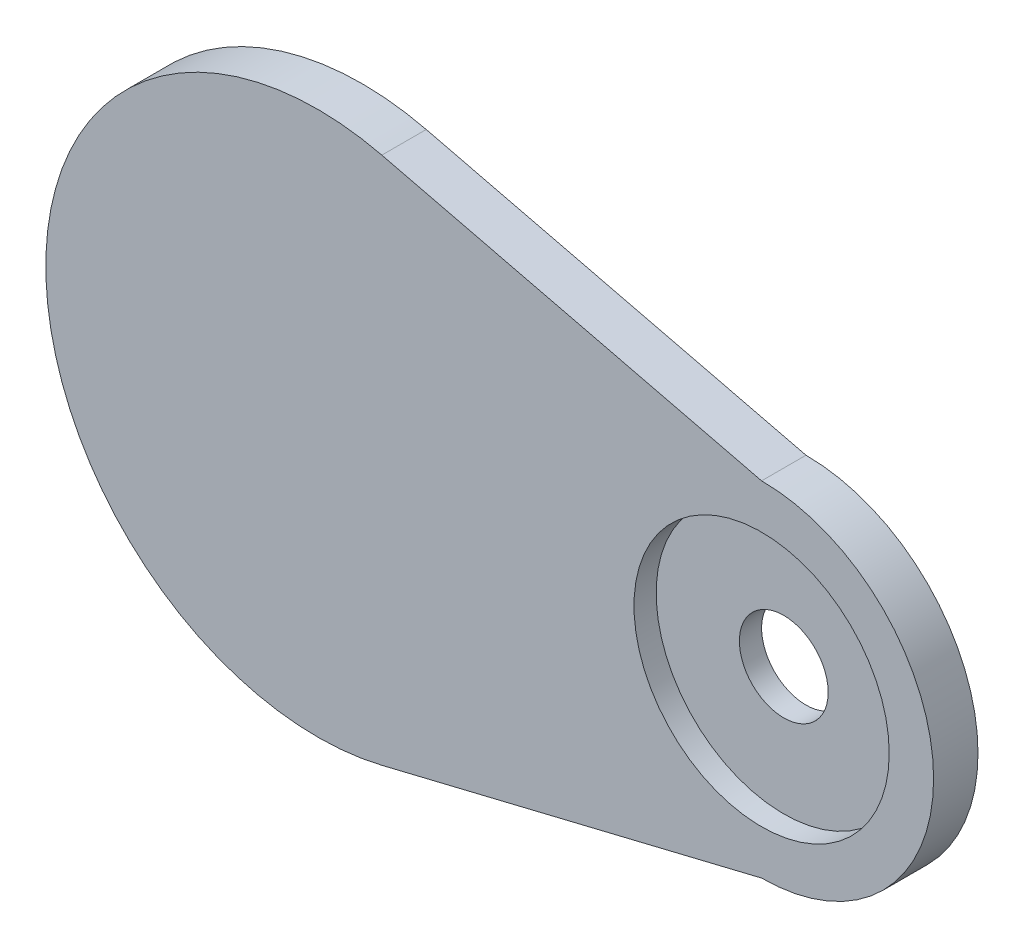
ISO-10303-21;
HEADER;
FILE_DESCRIPTION(('STEP AP214'),'2;1');
FILE_NAME('part.step','',(''),(''),'','','');
FILE_SCHEMA(('AUTOMOTIVE_DESIGN { 1 0 10303 214 1 1 1 1 }'));
ENDSEC;
DATA;
#1=APPLICATION_CONTEXT('core data for automotive mechanical design processes');
#2=APPLICATION_PROTOCOL_DEFINITION('international standard','automotive_design',2000,#1);
#3=PRODUCT_CONTEXT('',#1,'mechanical');
#4=PRODUCT('Part','Part','',(#3));
#5=PRODUCT_RELATED_PRODUCT_CATEGORY('part','',(#4));
#6=PRODUCT_DEFINITION_FORMATION('','',#4);
#7=PRODUCT_DEFINITION_CONTEXT('part definition',#1,'design');
#8=PRODUCT_DEFINITION('design','',#6,#7);
#9=PRODUCT_DEFINITION_SHAPE('','',#8);
#10=(LENGTH_UNIT() NAMED_UNIT(*) SI_UNIT(.MILLI.,.METRE.));
#11=(NAMED_UNIT(*) PLANE_ANGLE_UNIT() SI_UNIT($,.RADIAN.));
#12=(NAMED_UNIT(*) SI_UNIT($,.STERADIAN.) SOLID_ANGLE_UNIT());
#13=UNCERTAINTY_MEASURE_WITH_UNIT(LENGTH_MEASURE(1.E-05),#10,'distance_accuracy_value','');
#14=(GEOMETRIC_REPRESENTATION_CONTEXT(3) GLOBAL_UNCERTAINTY_ASSIGNED_CONTEXT((#13)) GLOBAL_UNIT_ASSIGNED_CONTEXT((#10,
#11,#12)) REPRESENTATION_CONTEXT('',''));
#15=CARTESIAN_POINT('',(0.,0.,0.));
#16=DIRECTION('',(0.,0.,1.));
#17=DIRECTION('',(1.,0.,0.));
#18=AXIS2_PLACEMENT_3D('',#15,#16,#17);
#19=CARTESIAN_POINT('',(4.50352233774654,18.5486828000679,4.));
#20=DIRECTION('',(-0.235940050150018,-0.971767612516082,0.));
#21=DIRECTION('',(0.971767612516082,-0.235940050150018,0.));
#22=AXIS2_PLACEMENT_3D('',#19,#20,#21);
#23=PLANE('',#22);
#24=DIRECTION('',(-0.971767612516082,0.235940050150018,0.));
#25=VECTOR('',#24,1.);
#26=CARTESIAN_POINT('',(4.50352233774654,18.5486828000679,0.));
#27=LINE('',#26,#25);
#28=CARTESIAN_POINT('',(13.4906393989021,16.3666581855379,0.));
#29=VERTEX_POINT('',#28);
#30=CARTESIAN_POINT('',(-20.7288293724225,24.674964692182,0.));
#31=VERTEX_POINT('',#30);
#32=EDGE_CURVE('E114',#29,#31,#27,.T.);
#33=ORIENTED_EDGE('',*,*,#32,.T.);
#34=DIRECTION('',(0.,0.,-1.));
#35=VECTOR('',#34,1.);
#36=CARTESIAN_POINT('',(-20.7288293724225,24.674964692182,4.));
#37=LINE('',#36,#35);
#38=CARTESIAN_POINT('',(-20.7288293724225,24.674964692182,4.));
#39=VERTEX_POINT('',#38);
#40=EDGE_CURVE('E11',#39,#31,#37,.T.);
#41=ORIENTED_EDGE('',*,*,#40,.F.);
#42=DIRECTION('',(-0.971767612516082,0.235940050150018,0.));
#43=VECTOR('',#42,1.);
#44=CARTESIAN_POINT('',(4.50352233774654,18.5486828000679,4.));
#45=LINE('',#44,#43);
#46=CARTESIAN_POINT('',(13.4906393989021,16.3666581855379,4.));
#47=VERTEX_POINT('',#46);
#48=EDGE_CURVE('E95',#47,#39,#45,.T.);
#49=ORIENTED_EDGE('',*,*,#48,.F.);
#50=DIRECTION('',(0.,0.,-1.));
#51=VECTOR('',#50,1.);
#52=CARTESIAN_POINT('',(13.4906393989021,16.3666581855379,4.));
#53=LINE('',#52,#51);
#54=EDGE_CURVE('E110',#47,#29,#53,.T.);
#55=ORIENTED_EDGE('',*,*,#54,.T.);
#56=EDGE_LOOP('',(#33,#41,#49,#55));
#57=FACE_BOUND('',#56,.T.);
#58=ADVANCED_FACE('F47',(#57),#23,.F.);
#59=CARTESIAN_POINT('',(-26.5093606010979,0.866658185537944,4.));
#60=DIRECTION('',(0.,0.,-1.));
#61=DIRECTION('',(-1.,0.,0.));
#62=AXIS2_PLACEMENT_3D('',#59,#60,#61);
#63=CYLINDRICAL_SURFACE('',#62,24.5);
#64=CARTESIAN_POINT('',(-26.5093606010979,0.866658185537944,0.));
#65=DIRECTION('',(0.,0.,1.));
#66=DIRECTION('',(1.,0.,0.));
#67=AXIS2_PLACEMENT_3D('',#64,#65,#66);
#68=CIRCLE('',#67,24.5);
#69=CARTESIAN_POINT('',(-20.7288293724225,-22.9416483211061,0.));
#70=VERTEX_POINT('',#69);
#71=EDGE_CURVE('E101',#31,#70,#68,.T.);
#72=ORIENTED_EDGE('',*,*,#71,.T.);
#73=DIRECTION('',(0.,0.,-1.));
#74=VECTOR('',#73,1.);
#75=CARTESIAN_POINT('',(-20.7288293724225,-22.9416483211061,4.));
#76=LINE('',#75,#74);
#77=CARTESIAN_POINT('',(-20.7288293724225,-22.9416483211061,4.));
#78=VERTEX_POINT('',#77);
#79=EDGE_CURVE('E56',#78,#70,#76,.T.);
#80=ORIENTED_EDGE('',*,*,#79,.F.);
#81=CARTESIAN_POINT('',(-26.5093606010979,0.866658185537944,4.));
#82=DIRECTION('',(0.,0.,1.));
#83=DIRECTION('',(1.,0.,0.));
#84=AXIS2_PLACEMENT_3D('',#81,#82,#83);
#85=CIRCLE('',#84,24.5);
#86=EDGE_CURVE('E90',#39,#78,#85,.T.);
#87=ORIENTED_EDGE('',*,*,#86,.F.);
#88=ORIENTED_EDGE('',*,*,#40,.T.);
#89=EDGE_LOOP('',(#72,#80,#87,#88));
#90=FACE_BOUND('',#89,.T.);
#91=ADVANCED_FACE('F100',(#90),#63,.T.);
#92=CARTESIAN_POINT('',(4.10610946816683,-16.9118561773344,4.));
#93=DIRECTION('',(0.235940050150018,-0.971767612516082,0.));
#94=DIRECTION('',(0.971767612516082,0.235940050150018,0.));
#95=AXIS2_PLACEMENT_3D('',#92,#93,#94);
#96=PLANE('',#95);
#97=DIRECTION('',(-0.971767612516082,-0.235940050150018,0.));
#98=VECTOR('',#97,1.);
#99=CARTESIAN_POINT('',(4.10610946816683,-16.9118561773344,0.));
#100=LINE('',#99,#98);
#101=CARTESIAN_POINT('',(13.4906393989021,-14.6333418144621,0.));
#102=VERTEX_POINT('',#101);
#103=EDGE_CURVE('E121',#102,#70,#100,.T.);
#104=ORIENTED_EDGE('',*,*,#103,.F.);
#105=DIRECTION('',(0.,0.,-1.));
#106=VECTOR('',#105,1.);
#107=CARTESIAN_POINT('',(13.4906393989021,-14.6333418144621,4.));
#108=LINE('',#107,#106);
#109=CARTESIAN_POINT('',(13.4906393989021,-14.6333418144621,4.));
#110=VERTEX_POINT('',#109);
#111=EDGE_CURVE('E80',#110,#102,#108,.T.);
#112=ORIENTED_EDGE('',*,*,#111,.F.);
#113=DIRECTION('',(-0.971767612516082,-0.235940050150018,0.));
#114=VECTOR('',#113,1.);
#115=CARTESIAN_POINT('',(4.10610946816683,-16.9118561773344,4.));
#116=LINE('',#115,#114);
#117=EDGE_CURVE('E93',#110,#78,#116,.T.);
#118=ORIENTED_EDGE('',*,*,#117,.T.);
#119=ORIENTED_EDGE('',*,*,#79,.T.);
#120=EDGE_LOOP('',(#104,#112,#118,#119));
#121=FACE_BOUND('',#120,.T.);
#122=ADVANCED_FACE('F106',(#121),#96,.T.);
#123=CARTESIAN_POINT('',(13.4906393989021,0.866658185537949,4.));
#124=DIRECTION('',(0.,0.,-1.));
#125=DIRECTION('',(-1.,0.,0.));
#126=AXIS2_PLACEMENT_3D('',#123,#124,#125);
#127=CYLINDRICAL_SURFACE('',#126,15.5);
#128=CARTESIAN_POINT('',(13.4906393989021,0.866658185537949,0.));
#129=DIRECTION('',(0.,0.,1.));
#130=DIRECTION('',(1.,0.,0.));
#131=AXIS2_PLACEMENT_3D('',#128,#129,#130);
#132=CIRCLE('',#131,15.5);
#133=EDGE_CURVE('E83',#102,#29,#132,.T.);
#134=ORIENTED_EDGE('',*,*,#133,.T.);
#135=ORIENTED_EDGE('',*,*,#54,.F.);
#136=CARTESIAN_POINT('',(13.4906393989021,0.866658185537949,4.));
#137=DIRECTION('',(0.,0.,1.));
#138=DIRECTION('',(1.,0.,0.));
#139=AXIS2_PLACEMENT_3D('',#136,#137,#138);
#140=CIRCLE('',#139,15.5);
#141=EDGE_CURVE('E64',#110,#47,#140,.T.);
#142=ORIENTED_EDGE('',*,*,#141,.F.);
#143=ORIENTED_EDGE('',*,*,#111,.T.);
#144=EDGE_LOOP('',(#134,#135,#142,#143));
#145=FACE_BOUND('',#144,.T.);
#146=ADVANCED_FACE('F145',(#145),#127,.T.);
#147=CARTESIAN_POINT('',(0.,0.,4.));
#148=DIRECTION('',(0.,0.,1.));
#149=DIRECTION('',(1.,0.,0.));
#150=AXIS2_PLACEMENT_3D('',#147,#148,#149);
#151=PLANE('',#150);
#152=CARTESIAN_POINT('',(13.4906393989021,0.866658185537949,4.));
#153=DIRECTION('',(0.,0.,1.));
#154=DIRECTION('',(1.,0.,0.));
#155=AXIS2_PLACEMENT_3D('',#152,#153,#154);
#156=CIRCLE('',#155,11.5);
#157=CARTESIAN_POINT('',(24.9906393989021,0.866658185537949,4.));
#158=VERTEX_POINT('',#157);
#159=EDGE_CURVE('E207',#158,#158,#156,.T.);
#160=ORIENTED_EDGE('',*,*,#159,.F.);
#161=EDGE_LOOP('',(#160));
#162=FACE_BOUND('',#161,.T.);
#163=ORIENTED_EDGE('',*,*,#48,.T.);
#164=ORIENTED_EDGE('',*,*,#86,.T.);
#165=ORIENTED_EDGE('',*,*,#117,.F.);
#166=ORIENTED_EDGE('',*,*,#141,.T.);
#167=EDGE_LOOP('',(#163,#164,#165,#166));
#168=FACE_BOUND('',#167,.T.);
#169=ADVANCED_FACE('F91',(#162,#168),#151,.T.);
#170=CARTESIAN_POINT('',(0.,0.,0.));
#171=DIRECTION('',(0.,0.,1.));
#172=DIRECTION('',(1.,0.,0.));
#173=AXIS2_PLACEMENT_3D('',#170,#171,#172);
#174=PLANE('',#173);
#175=CARTESIAN_POINT('',(13.4906393989021,0.866658185537949,0.));
#176=DIRECTION('',(0.,0.,1.));
#177=DIRECTION('',(1.,0.,0.));
#178=AXIS2_PLACEMENT_3D('',#175,#176,#177);
#179=CIRCLE('',#178,4.);
#180=CARTESIAN_POINT('',(17.4906393989021,0.866658185537949,0.));
#181=VERTEX_POINT('',#180);
#182=EDGE_CURVE('E200',#181,#181,#179,.T.);
#183=ORIENTED_EDGE('',*,*,#182,.T.);
#184=EDGE_LOOP('',(#183));
#185=FACE_BOUND('',#184,.T.);
#186=ORIENTED_EDGE('',*,*,#32,.F.);
#187=ORIENTED_EDGE('',*,*,#133,.F.);
#188=ORIENTED_EDGE('',*,*,#103,.T.);
#189=ORIENTED_EDGE('',*,*,#71,.F.);
#190=EDGE_LOOP('',(#186,#187,#188,#189));
#191=FACE_BOUND('',#190,.T.);
#192=ADVANCED_FACE('F132',(#185,#191),#174,.F.);
#193=CARTESIAN_POINT('',(13.4906393989021,0.866658185537949,2.));
#194=DIRECTION('',(0.,0.,1.));
#195=DIRECTION('',(1.,0.,0.));
#196=AXIS2_PLACEMENT_3D('',#193,#194,#195);
#197=CYLINDRICAL_SURFACE('',#196,11.5);
#198=CARTESIAN_POINT('',(13.4906393989021,0.866658185537949,2.));
#199=DIRECTION('',(0.,0.,1.));
#200=DIRECTION('',(1.,0.,0.));
#201=AXIS2_PLACEMENT_3D('',#198,#199,#200);
#202=CIRCLE('',#201,11.5);
#203=CARTESIAN_POINT('',(24.9906393989021,0.866658185537949,2.));
#204=VERTEX_POINT('',#203);
#205=EDGE_CURVE('E118',#204,#204,#202,.T.);
#206=ORIENTED_EDGE('',*,*,#205,.F.);
#207=EDGE_LOOP('',(#206));
#208=FACE_BOUND('',#207,.T.);
#209=ORIENTED_EDGE('',*,*,#159,.T.);
#210=EDGE_LOOP('',(#209));
#211=FACE_BOUND('',#210,.T.);
#212=ADVANCED_FACE('F134',(#208,#211),#197,.F.);
#213=CARTESIAN_POINT('',(13.4906393989021,0.866658185537949,2.));
#214=DIRECTION('',(0.,0.,1.));
#215=DIRECTION('',(1.,0.,0.));
#216=AXIS2_PLACEMENT_3D('',#213,#214,#215);
#217=PLANE('',#216);
#218=CARTESIAN_POINT('',(13.4906393989021,0.866658185537949,2.));
#219=DIRECTION('',(0.,0.,1.));
#220=DIRECTION('',(1.,0.,0.));
#221=AXIS2_PLACEMENT_3D('',#218,#219,#220);
#222=CIRCLE('',#221,4.);
#223=CARTESIAN_POINT('',(17.4906393989021,0.866658185537949,2.));
#224=VERTEX_POINT('',#223);
#225=EDGE_CURVE('E203',#224,#224,#222,.T.);
#226=ORIENTED_EDGE('',*,*,#225,.F.);
#227=EDGE_LOOP('',(#226));
#228=FACE_BOUND('',#227,.T.);
#229=ORIENTED_EDGE('',*,*,#205,.T.);
#230=EDGE_LOOP('',(#229));
#231=FACE_BOUND('',#230,.T.);
#232=ADVANCED_FACE('F141',(#228,#231),#217,.T.);
#233=CARTESIAN_POINT('',(13.4906393989021,0.866658185537949,0.));
#234=DIRECTION('',(0.,0.,1.));
#235=DIRECTION('',(1.,0.,0.));
#236=AXIS2_PLACEMENT_3D('',#233,#234,#235);
#237=CYLINDRICAL_SURFACE('',#236,4.);
#238=ORIENTED_EDGE('',*,*,#182,.F.);
#239=EDGE_LOOP('',(#238));
#240=FACE_BOUND('',#239,.T.);
#241=ORIENTED_EDGE('',*,*,#225,.T.);
#242=EDGE_LOOP('',(#241));
#243=FACE_BOUND('',#242,.T.);
#244=ADVANCED_FACE('F185',(#240,#243),#237,.F.);
#245=CLOSED_SHELL('',(#58,#91,#122,#146,#169,#192,#212,#232,#244));
#246=MANIFOLD_SOLID_BREP('B2',#245);
#247=ADVANCED_BREP_SHAPE_REPRESENTATION('',(#18,#246),#14);
#248=SHAPE_DEFINITION_REPRESENTATION(#9,#247);
ENDSEC;
END-ISO-10303-21;
